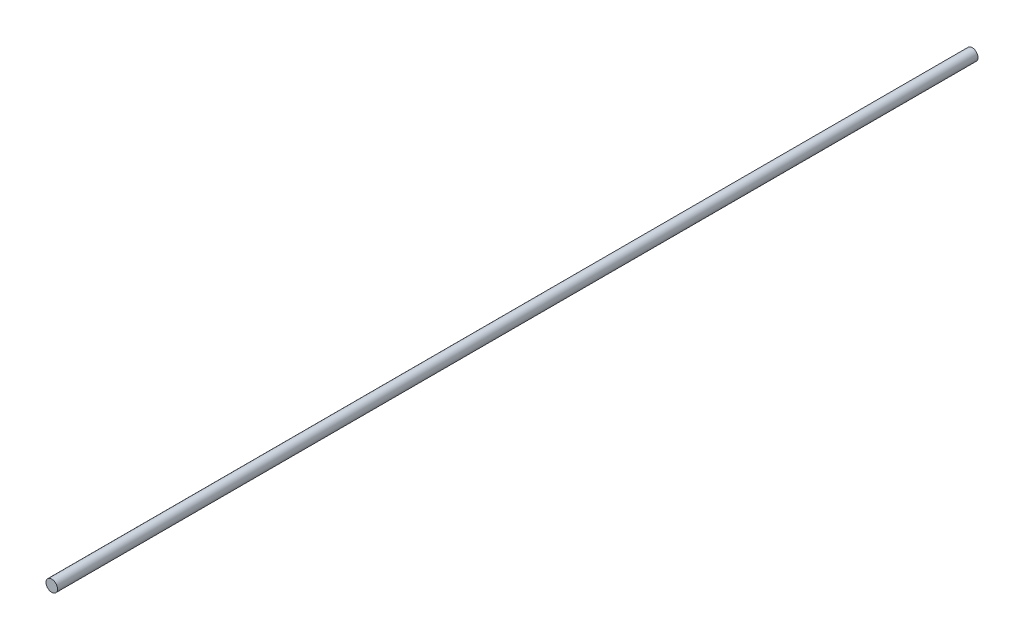
ISO-10303-21;
HEADER;
FILE_DESCRIPTION(('STEP AP214'),'2;1');
FILE_NAME('part.step','',(''),(''),'','','');
FILE_SCHEMA(('AUTOMOTIVE_DESIGN { 1 0 10303 214 1 1 1 1 }'));
ENDSEC;
DATA;
#1=APPLICATION_CONTEXT('core data for automotive mechanical design processes');
#2=APPLICATION_PROTOCOL_DEFINITION('international standard','automotive_design',2000,#1);
#3=PRODUCT_CONTEXT('',#1,'mechanical');
#4=PRODUCT('Part','Part','',(#3));
#5=PRODUCT_RELATED_PRODUCT_CATEGORY('part','',(#4));
#6=PRODUCT_DEFINITION_FORMATION('','',#4);
#7=PRODUCT_DEFINITION_CONTEXT('part definition',#1,'design');
#8=PRODUCT_DEFINITION('design','',#6,#7);
#9=PRODUCT_DEFINITION_SHAPE('','',#8);
#10=(LENGTH_UNIT() NAMED_UNIT(*) SI_UNIT(.MILLI.,.METRE.));
#11=(NAMED_UNIT(*) PLANE_ANGLE_UNIT() SI_UNIT($,.RADIAN.));
#12=(NAMED_UNIT(*) SI_UNIT($,.STERADIAN.) SOLID_ANGLE_UNIT());
#13=UNCERTAINTY_MEASURE_WITH_UNIT(LENGTH_MEASURE(1.E-05),#10,'distance_accuracy_value','');
#14=(GEOMETRIC_REPRESENTATION_CONTEXT(3) GLOBAL_UNCERTAINTY_ASSIGNED_CONTEXT((#13)) GLOBAL_UNIT_ASSIGNED_CONTEXT((#10,
#11,#12)) REPRESENTATION_CONTEXT('',''));
#15=CARTESIAN_POINT('',(0.,0.,0.));
#16=DIRECTION('',(0.,0.,1.));
#17=DIRECTION('',(1.,0.,0.));
#18=AXIS2_PLACEMENT_3D('',#15,#16,#17);
#19=CARTESIAN_POINT('',(0.,0.,508.));
#20=DIRECTION('',(0.,0.,-1.));
#21=DIRECTION('',(-1.,0.,0.));
#22=AXIS2_PLACEMENT_3D('',#19,#20,#21);
#23=CYLINDRICAL_SURFACE('',#22,3.175);
#24=CARTESIAN_POINT('',(0.,0.,508.));
#25=DIRECTION('',(0.,0.,1.));
#26=DIRECTION('',(1.,0.,0.));
#27=AXIS2_PLACEMENT_3D('',#24,#25,#26);
#28=CIRCLE('',#27,3.175);
#29=CARTESIAN_POINT('',(3.175,0.,508.));
#30=VERTEX_POINT('',#29);
#31=EDGE_CURVE('E10',#30,#30,#28,.T.);
#32=ORIENTED_EDGE('',*,*,#31,.F.);
#33=EDGE_LOOP('',(#32));
#34=FACE_BOUND('',#33,.T.);
#35=CARTESIAN_POINT('',(0.,0.,0.));
#36=DIRECTION('',(0.,0.,1.));
#37=DIRECTION('',(1.,0.,0.));
#38=AXIS2_PLACEMENT_3D('',#35,#36,#37);
#39=CIRCLE('',#38,3.175);
#40=CARTESIAN_POINT('',(3.175,0.,0.));
#41=VERTEX_POINT('',#40);
#42=EDGE_CURVE('E33',#41,#41,#39,.T.);
#43=ORIENTED_EDGE('',*,*,#42,.T.);
#44=EDGE_LOOP('',(#43));
#45=FACE_BOUND('',#44,.T.);
#46=ADVANCED_FACE('F30',(#34,#45),#23,.T.);
#47=CARTESIAN_POINT('',(0.,0.,508.));
#48=DIRECTION('',(0.,0.,1.));
#49=DIRECTION('',(1.,0.,0.));
#50=AXIS2_PLACEMENT_3D('',#47,#48,#49);
#51=PLANE('',#50);
#52=ORIENTED_EDGE('',*,*,#31,.T.);
#53=EDGE_LOOP('',(#52));
#54=FACE_BOUND('',#53,.T.);
#55=ADVANCED_FACE('F45',(#54),#51,.T.);
#56=CARTESIAN_POINT('',(0.,0.,0.));
#57=DIRECTION('',(0.,0.,1.));
#58=DIRECTION('',(1.,0.,0.));
#59=AXIS2_PLACEMENT_3D('',#56,#57,#58);
#60=PLANE('',#59);
#61=ORIENTED_EDGE('',*,*,#42,.F.);
#62=EDGE_LOOP('',(#61));
#63=FACE_BOUND('',#62,.T.);
#64=ADVANCED_FACE('F43',(#63),#60,.F.);
#65=CLOSED_SHELL('',(#46,#55,#64));
#66=MANIFOLD_SOLID_BREP('B2',#65);
#67=ADVANCED_BREP_SHAPE_REPRESENTATION('',(#18,#66),#14);
#68=SHAPE_DEFINITION_REPRESENTATION(#9,#67);
ENDSEC;
END-ISO-10303-21;
